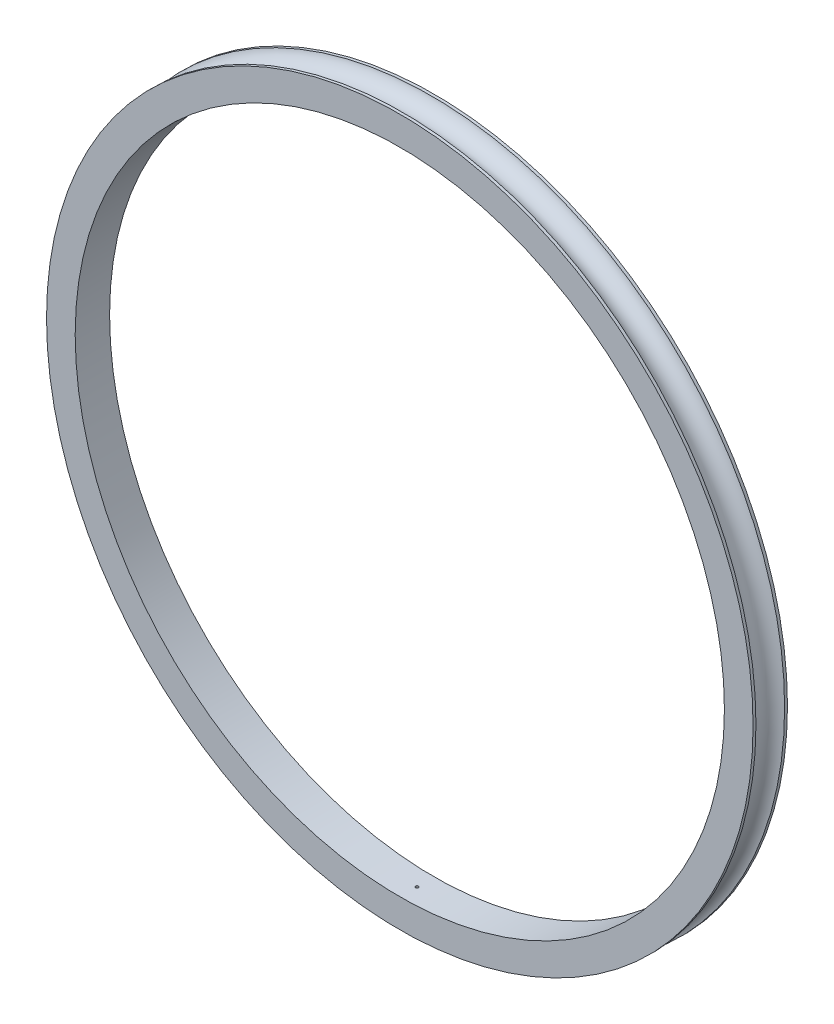
ISO-10303-21;
HEADER;
FILE_DESCRIPTION(('STEP AP214'),'2;1');
FILE_NAME('part.step','',(''),(''),'','','');
FILE_SCHEMA(('AUTOMOTIVE_DESIGN { 1 0 10303 214 1 1 1 1 }'));
ENDSEC;
DATA;
#1=APPLICATION_CONTEXT('core data for automotive mechanical design processes');
#2=APPLICATION_PROTOCOL_DEFINITION('international standard','automotive_design',2000,#1);
#3=PRODUCT_CONTEXT('',#1,'mechanical');
#4=PRODUCT('Part','Part','',(#3));
#5=PRODUCT_RELATED_PRODUCT_CATEGORY('part','',(#4));
#6=PRODUCT_DEFINITION_FORMATION('','',#4);
#7=PRODUCT_DEFINITION_CONTEXT('part definition',#1,'design');
#8=PRODUCT_DEFINITION('design','',#6,#7);
#9=PRODUCT_DEFINITION_SHAPE('','',#8);
#10=(LENGTH_UNIT() NAMED_UNIT(*) SI_UNIT(.MILLI.,.METRE.));
#11=(NAMED_UNIT(*) PLANE_ANGLE_UNIT() SI_UNIT($,.RADIAN.));
#12=(NAMED_UNIT(*) SI_UNIT($,.STERADIAN.) SOLID_ANGLE_UNIT());
#13=UNCERTAINTY_MEASURE_WITH_UNIT(LENGTH_MEASURE(1.E-05),#10,'distance_accuracy_value','');
#14=(GEOMETRIC_REPRESENTATION_CONTEXT(3) GLOBAL_UNCERTAINTY_ASSIGNED_CONTEXT((#13)) GLOBAL_UNIT_ASSIGNED_CONTEXT((#10,
#11,#12)) REPRESENTATION_CONTEXT('',''));
#15=CARTESIAN_POINT('',(0.,0.,0.));
#16=DIRECTION('',(0.,0.,1.));
#17=DIRECTION('',(1.,0.,0.));
#18=AXIS2_PLACEMENT_3D('',#15,#16,#17);
#19=CARTESIAN_POINT('',(0.,0.,80.7858217632019));
#20=DIRECTION('',(0.,0.,1.));
#21=DIRECTION('',(1.,0.,0.));
#22=AXIS2_PLACEMENT_3D('',#19,#20,#21);
#23=CYLINDRICAL_SURFACE('',#22,113.24716621);
#24=CARTESIAN_POINT('',(0.,0.,-5.99999999999999));
#25=DIRECTION('',(0.,0.,1.));
#26=DIRECTION('',(1.,0.,0.));
#27=AXIS2_PLACEMENT_3D('',#24,#25,#26);
#28=CIRCLE('',#27,113.24716621);
#29=CARTESIAN_POINT('',(113.24716621,0.,-5.99999999999999));
#30=VERTEX_POINT('',#29);
#31=EDGE_CURVE('E10',#30,#30,#28,.T.);
#32=ORIENTED_EDGE('',*,*,#31,.F.);
#33=EDGE_LOOP('',(#32));
#34=FACE_BOUND('',#33,.T.);
#35=CARTESIAN_POINT('',(0.,0.,6.00000000000001));
#36=DIRECTION('',(0.,0.,1.));
#37=DIRECTION('',(1.,0.,0.));
#38=AXIS2_PLACEMENT_3D('',#35,#36,#37);
#39=CIRCLE('',#38,113.24716621);
#40=CARTESIAN_POINT('',(113.24716621,0.,6.00000000000001));
#41=VERTEX_POINT('',#40);
#42=EDGE_CURVE('E62',#41,#41,#39,.T.);
#43=ORIENTED_EDGE('',*,*,#42,.T.);
#44=EDGE_LOOP('',(#43));
#45=FACE_BOUND('',#44,.T.);
#46=CARTESIAN_POINT('',(0.,113.24716621,0.5));
#47=CARTESIAN_POINT('',(-0.0280850726443126,113.247166195074,0.499998754627197));
#48=CARTESIAN_POINT('',(-0.0561905061239835,113.247155650258,0.497625745990981));
#49=CARTESIAN_POINT('',(-0.111627324699866,113.2471145986,0.488192279230288));
#50=CARTESIAN_POINT('',(-0.138957736940247,113.247084067735,0.481126179969488));
#51=CARTESIAN_POINT('',(-0.192033351037611,113.247006502595,0.46250770041119));
#52=CARTESIAN_POINT('',(-0.217779303653711,113.246959476208,0.450957464075767));
#53=CARTESIAN_POINT('',(-0.266959440226378,113.246854229004,0.423701526711973));
#54=CARTESIAN_POINT('',(-0.290394196813115,113.24679601097,0.40799685856923));
#55=CARTESIAN_POINT('',(-0.334297575428407,113.246674929301,0.372874571112933));
#56=CARTESIAN_POINT('',(-0.354765868728772,113.246612065153,0.353456540855887));
#57=CARTESIAN_POINT('',(-0.392152692303786,113.246488781309,0.31145899001049));
#58=CARTESIAN_POINT('',(-0.409071083131932,113.24642836171,0.28887934528635));
#59=CARTESIAN_POINT('',(-0.438876664259513,113.246316782586,0.241200476716012));
#60=CARTESIAN_POINT('',(-0.451763913187517,113.246265622927,0.216101289520828));
#61=CARTESIAN_POINT('',(-0.473141663153759,113.246178330635,0.164095600067725));
#62=CARTESIAN_POINT('',(-0.481632173223372,113.246142197972,0.137189101522346));
#63=CARTESIAN_POINT('',(-0.493975426743541,113.24608903346,0.0823326761827823));
#64=CARTESIAN_POINT('',(-0.497828192011973,113.246072001522,0.054382754297932));
#65=CARTESIAN_POINT('',(-0.500786648223638,113.246058958438,-0.00176715906982723));
#66=CARTESIAN_POINT('',(-0.499892347945962,113.246062947254,-0.0299671500901692));
#67=CARTESIAN_POINT('',(-0.493382103939976,113.246091495775,-0.0858165414675148));
#68=CARTESIAN_POINT('',(-0.487766191387806,113.246116055345,-0.113465945458733));
#69=CARTESIAN_POINT('',(-0.471972182082359,113.246182976294,-0.167429505712772));
#70=CARTESIAN_POINT('',(-0.46179408039958,113.246225337692,-0.193743660532805));
#71=CARTESIAN_POINT('',(-0.437164584173988,113.246323086535,-0.244289807809644));
#72=CARTESIAN_POINT('',(-0.422713175864576,113.246378474023,-0.268521793558349));
#73=CARTESIAN_POINT('',(-0.389947315899648,113.246496030469,-0.314215647426464));
#74=CARTESIAN_POINT('',(-0.371632865582639,113.246558199426,-0.335677516505689));
#75=CARTESIAN_POINT('',(-0.331660622040299,113.246682310422,-0.375222103881902));
#76=CARTESIAN_POINT('',(-0.310002799828359,113.246744252458,-0.393304792878824));
#77=CARTESIAN_POINT('',(-0.263958713663192,113.246860925619,-0.425577482561601));
#78=CARTESIAN_POINT('',(-0.239572449351861,113.246915656743,-0.439767482736546));
#79=CARTESIAN_POINT('',(-0.18876372077247,113.247011737584,-0.46385197553293));
#80=CARTESIAN_POINT('',(-0.162341256185237,113.247053087298,-0.473746467481051));
#81=CARTESIAN_POINT('',(-0.108210190130271,113.247117743424,-0.488959050783277));
#82=CARTESIAN_POINT('',(-0.0805015887950285,113.247141049837,-0.494277142608817));
#83=CARTESIAN_POINT('',(-0.0245850642340972,113.247166991616,-0.500185926265634));
#84=CARTESIAN_POINT('',(0.00362285477255126,113.247169627157,-0.500776658022181));
#85=CARTESIAN_POINT('',(0.0597374966472364,113.247153930515,-0.497214056297327));
#86=CARTESIAN_POINT('',(0.0876442195095471,113.247135598333,-0.493060722725735));
#87=CARTESIAN_POINT('',(0.142364168567434,113.247080033155,-0.480127923639521));
#88=CARTESIAN_POINT('',(0.169177398988621,113.247042800232,-0.47134847600354));
#89=CARTESIAN_POINT('',(0.220949341072637,113.24695363126,-0.449412691014909));
#90=CARTESIAN_POINT('',(0.245908052891495,113.246901695212,-0.43625635403051));
#91=CARTESIAN_POINT('',(0.293262638443112,113.246788974853,-0.405940158433058));
#92=CARTESIAN_POINT('',(0.315658495278256,113.246728190484,-0.38878027342577));
#93=CARTESIAN_POINT('',(0.357251458022419,113.24660462657,-0.350944131166159));
#94=CARTESIAN_POINT('',(0.376448562488145,113.246541847023,-0.33026787232724));
#95=CARTESIAN_POINT('',(0.411099198726588,113.246421370171,-0.28598574738278));
#96=CARTESIAN_POINT('',(0.426552703590167,113.246363672903,-0.262379860220801));
#97=CARTESIAN_POINT('',(0.453277263312564,113.246259866169,-0.212908714583959));
#98=CARTESIAN_POINT('',(0.464548322695467,113.24621375669,-0.187043458553058));
#99=CARTESIAN_POINT('',(0.482588013812692,113.246138324217,-0.133787899119342));
#100=CARTESIAN_POINT('',(0.489356663962868,113.246109001155,-0.106397601954781));
#101=CARTESIAN_POINT('',(0.498199464018572,113.246070447225,-0.0508693497111937));
#102=CARTESIAN_POINT('',(0.500273605736881,113.246061216392,-0.0227313933283364));
#103=CARTESIAN_POINT('',(0.499668485789901,113.24606388776,0.033493065741273));
#104=CARTESIAN_POINT('',(0.49698927356097,113.246075789742,0.0615795689601129));
#105=CARTESIAN_POINT('',(0.486953586454943,113.246119384465,0.116904178825799));
#106=CARTESIAN_POINT('',(0.47959710217483,113.246151077246,0.144142283766941));
#107=CARTESIAN_POINT('',(0.460415539341316,113.246230681203,0.196997326642429));
#108=CARTESIAN_POINT('',(0.448590377633274,113.246278592681,0.22261423439864));
#109=CARTESIAN_POINT('',(0.420807645071397,113.246385229927,0.271498180057277));
#110=CARTESIAN_POINT('',(0.404850236200105,113.246443955271,0.29476531002043));
#111=CARTESIAN_POINT('',(0.369257731467463,113.246565595214,0.338288285177159));
#112=CARTESIAN_POINT('',(0.349622989268236,113.246628509411,0.358544419613055));
#113=CARTESIAN_POINT('',(0.307225770102929,113.24675145585,0.39547793237453));
#114=CARTESIAN_POINT('',(0.284462517016839,113.246811487372,0.412154420024291));
#115=CARTESIAN_POINT('',(0.236450377144567,113.246921909687,0.441455418968024));
#116=CARTESIAN_POINT('',(0.211200299585207,113.246972295826,0.454077976660228));
#117=CARTESIAN_POINT('',(0.158959157690725,113.247057648375,0.474890257125589));
#118=CARTESIAN_POINT('',(0.131970223946102,113.247092633259,0.483085293455131));
#119=CARTESIAN_POINT('',(0.0873411009489131,113.247133838102,0.492626014150176));
#120=CARTESIAN_POINT('',(0.0699908952107105,113.247145925261,0.495387807152349));
#121=CARTESIAN_POINT('',(0.035096443837638,113.247162115874,0.499075189228983));
#122=CARTESIAN_POINT('',(0.0175521982039778,113.247166219328,0.500000778314892));
#123=CARTESIAN_POINT('',(0.,113.24716621,0.5));
#124=B_SPLINE_CURVE_WITH_KNOTS('',3,(#46,#47,#48,#49,#50,#51,#52,#53,#54,#55,#56,#57,#58,#59,
#60,#61,#62,#63,#64,#65,#66,#67,#68,#69,#70,#71,#72,#73,#74,#75,#76,#77,#78,#79,#80,#81,#82,#83,
#84,#85,#86,#87,#88,#89,#90,#91,#92,#93,#94,#95,#96,#97,#98,#99,#100,#101,#102,#103,#104,#105,
#106,#107,#108,#109,#110,#111,#112,#113,#114,#115,#116,#117,#118,#119,#120,#121,#122,#123),
.UNSPECIFIED.,.T.,.F.,(4,2,2,2,2,2,2,2,2,2,2,2,2,2,2,2,2,2,2,2,2,2,2,2,2,2,2,2,2,2,2,2,2,2,2,2,
2,2,4),(0.,0.0841911524058577,0.168483686911669,0.252735968885035,0.336967323492173,
0.421208005059153,0.505451995131177,0.589694759909137,0.673937351642701,0.758179547062601,
0.842421586687417,0.926663070078301,1.01090464449337,1.09514649029841,1.1793883069145,
1.26363085393743,1.34787341201708,1.43211598330168,1.5163585459081,1.60060039703695,
1.68484224976734,1.76908377692885,1.85332529700269,1.93756737247224,2.02180948595209,
2.10605220494951,2.19029483282261,2.27453711612252,2.3587795463408,2.44302110041679,
2.52726282384948,2.61150611495746,2.69574610425971,2.77997799606133,2.86423082193048,
2.9485241887941,3.03271616752045,3.08533272372367,3.13794927959888),.UNSPECIFIED.);
#125=CARTESIAN_POINT('',(0.,113.24716621,0.5));
#126=VERTEX_POINT('',#125);
#127=EDGE_CURVE('E56',#126,#126,#124,.T.);
#128=ORIENTED_EDGE('',*,*,#127,.F.);
#129=EDGE_LOOP('',(#128));
#130=FACE_BOUND('',#129,.T.);
#131=CARTESIAN_POINT('',(0.,-113.24716621,-0.5));
#132=CARTESIAN_POINT('',(-0.0280850726443126,-113.247166195074,-0.499998754627197));
#133=CARTESIAN_POINT('',(-0.0561905061239835,-113.247155650258,-0.497625745990981));
#134=CARTESIAN_POINT('',(-0.111627324699866,-113.2471145986,-0.488192279230288));
#135=CARTESIAN_POINT('',(-0.138957736940247,-113.247084067735,-0.481126179969488));
#136=CARTESIAN_POINT('',(-0.192033351037611,-113.247006502595,-0.46250770041119));
#137=CARTESIAN_POINT('',(-0.217779303653711,-113.246959476208,-0.450957464075767));
#138=CARTESIAN_POINT('',(-0.266959440226378,-113.246854229004,-0.423701526711973));
#139=CARTESIAN_POINT('',(-0.290394196813115,-113.24679601097,-0.40799685856923));
#140=CARTESIAN_POINT('',(-0.334297575428407,-113.246674929301,-0.372874571112933));
#141=CARTESIAN_POINT('',(-0.354765868728772,-113.246612065153,-0.353456540855887));
#142=CARTESIAN_POINT('',(-0.392152692303786,-113.246488781309,-0.31145899001049));
#143=CARTESIAN_POINT('',(-0.409071083131932,-113.24642836171,-0.28887934528635));
#144=CARTESIAN_POINT('',(-0.438876664259513,-113.246316782586,-0.241200476716012));
#145=CARTESIAN_POINT('',(-0.451763913187517,-113.246265622927,-0.216101289520828));
#146=CARTESIAN_POINT('',(-0.473141663153759,-113.246178330635,-0.164095600067725));
#147=CARTESIAN_POINT('',(-0.481632173223372,-113.246142197972,-0.137189101522346));
#148=CARTESIAN_POINT('',(-0.493975426743541,-113.24608903346,-0.0823326761827823));
#149=CARTESIAN_POINT('',(-0.497828192011973,-113.246072001522,-0.054382754297932));
#150=CARTESIAN_POINT('',(-0.500786648223638,-113.246058958438,0.00176715906982723));
#151=CARTESIAN_POINT('',(-0.499892347945962,-113.246062947254,0.0299671500901692));
#152=CARTESIAN_POINT('',(-0.493382103939976,-113.246091495775,0.0858165414675148));
#153=CARTESIAN_POINT('',(-0.487766191387806,-113.246116055345,0.113465945458733));
#154=CARTESIAN_POINT('',(-0.471972182082359,-113.246182976294,0.167429505712772));
#155=CARTESIAN_POINT('',(-0.46179408039958,-113.246225337692,0.193743660532805));
#156=CARTESIAN_POINT('',(-0.437164584173988,-113.246323086535,0.244289807809644));
#157=CARTESIAN_POINT('',(-0.422713175864576,-113.246378474023,0.268521793558349));
#158=CARTESIAN_POINT('',(-0.389947315899648,-113.246496030469,0.314215647426464));
#159=CARTESIAN_POINT('',(-0.371632865582639,-113.246558199426,0.335677516505689));
#160=CARTESIAN_POINT('',(-0.331660622040299,-113.246682310422,0.375222103881902));
#161=CARTESIAN_POINT('',(-0.310002799828359,-113.246744252458,0.393304792878824));
#162=CARTESIAN_POINT('',(-0.263958713663192,-113.246860925619,0.425577482561601));
#163=CARTESIAN_POINT('',(-0.239572449351861,-113.246915656743,0.439767482736546));
#164=CARTESIAN_POINT('',(-0.18876372077247,-113.247011737584,0.46385197553293));
#165=CARTESIAN_POINT('',(-0.162341256185237,-113.247053087298,0.473746467481051));
#166=CARTESIAN_POINT('',(-0.108210190130271,-113.247117743424,0.488959050783277));
#167=CARTESIAN_POINT('',(-0.0805015887950285,-113.247141049837,0.494277142608817));
#168=CARTESIAN_POINT('',(-0.0245850642340972,-113.247166991616,0.500185926265634));
#169=CARTESIAN_POINT('',(0.00362285477255126,-113.247169627157,0.500776658022181));
#170=CARTESIAN_POINT('',(0.0597374966472364,-113.247153930515,0.497214056297327));
#171=CARTESIAN_POINT('',(0.0876442195095471,-113.247135598333,0.493060722725735));
#172=CARTESIAN_POINT('',(0.142364168567434,-113.247080033155,0.480127923639521));
#173=CARTESIAN_POINT('',(0.169177398988621,-113.247042800232,0.47134847600354));
#174=CARTESIAN_POINT('',(0.220949341072637,-113.24695363126,0.449412691014909));
#175=CARTESIAN_POINT('',(0.245908052891495,-113.246901695212,0.43625635403051));
#176=CARTESIAN_POINT('',(0.293262638443112,-113.246788974853,0.405940158433058));
#177=CARTESIAN_POINT('',(0.315658495278256,-113.246728190484,0.38878027342577));
#178=CARTESIAN_POINT('',(0.357251458022419,-113.24660462657,0.350944131166159));
#179=CARTESIAN_POINT('',(0.376448562488145,-113.246541847023,0.33026787232724));
#180=CARTESIAN_POINT('',(0.411099198726588,-113.246421370171,0.28598574738278));
#181=CARTESIAN_POINT('',(0.426552703590167,-113.246363672903,0.262379860220801));
#182=CARTESIAN_POINT('',(0.453277263312564,-113.246259866169,0.212908714583959));
#183=CARTESIAN_POINT('',(0.464548322695467,-113.24621375669,0.187043458553058));
#184=CARTESIAN_POINT('',(0.482588013812692,-113.246138324217,0.133787899119342));
#185=CARTESIAN_POINT('',(0.489356663962868,-113.246109001155,0.106397601954781));
#186=CARTESIAN_POINT('',(0.498199464018572,-113.246070447225,0.0508693497111937));
#187=CARTESIAN_POINT('',(0.500273605736881,-113.246061216392,0.0227313933283364));
#188=CARTESIAN_POINT('',(0.499668485789901,-113.24606388776,-0.033493065741273));
#189=CARTESIAN_POINT('',(0.49698927356097,-113.246075789742,-0.0615795689601129));
#190=CARTESIAN_POINT('',(0.486953586454943,-113.246119384465,-0.116904178825799));
#191=CARTESIAN_POINT('',(0.47959710217483,-113.246151077246,-0.144142283766941));
#192=CARTESIAN_POINT('',(0.460415539341316,-113.246230681203,-0.196997326642429));
#193=CARTESIAN_POINT('',(0.448590377633274,-113.246278592681,-0.22261423439864));
#194=CARTESIAN_POINT('',(0.420807645071397,-113.246385229927,-0.271498180057277));
#195=CARTESIAN_POINT('',(0.404850236200105,-113.246443955271,-0.29476531002043));
#196=CARTESIAN_POINT('',(0.369257731467463,-113.246565595214,-0.338288285177159));
#197=CARTESIAN_POINT('',(0.349622989268236,-113.246628509411,-0.358544419613055));
#198=CARTESIAN_POINT('',(0.307225770102929,-113.24675145585,-0.39547793237453));
#199=CARTESIAN_POINT('',(0.284462517016839,-113.246811487372,-0.412154420024291));
#200=CARTESIAN_POINT('',(0.236450377144567,-113.246921909687,-0.441455418968024));
#201=CARTESIAN_POINT('',(0.211200299585207,-113.246972295826,-0.454077976660228));
#202=CARTESIAN_POINT('',(0.158959157690725,-113.247057648375,-0.474890257125589));
#203=CARTESIAN_POINT('',(0.131970223946102,-113.247092633259,-0.483085293455131));
#204=CARTESIAN_POINT('',(0.0873411009489131,-113.247133838102,-0.492626014150176));
#205=CARTESIAN_POINT('',(0.0699908952107105,-113.247145925261,-0.495387807152349));
#206=CARTESIAN_POINT('',(0.035096443837638,-113.247162115874,-0.499075189228983));
#207=CARTESIAN_POINT('',(0.0175521982039778,-113.247166219328,-0.500000778314892));
#208=CARTESIAN_POINT('',(0.,-113.24716621,-0.5));
#209=B_SPLINE_CURVE_WITH_KNOTS('',3,(#131,#132,#133,#134,#135,#136,#137,#138,#139,#140,#141,
#142,#143,#144,#145,#146,#147,#148,#149,#150,#151,#152,#153,#154,#155,#156,#157,#158,#159,#160,
#161,#162,#163,#164,#165,#166,#167,#168,#169,#170,#171,#172,#173,#174,#175,#176,#177,#178,#179,
#180,#181,#182,#183,#184,#185,#186,#187,#188,#189,#190,#191,#192,#193,#194,#195,#196,#197,#198,
#199,#200,#201,#202,#203,#204,#205,#206,#207,#208),.UNSPECIFIED.,.T.,.F.,(4,2,2,2,2,2,2,2,2,2,2,
2,2,2,2,2,2,2,2,2,2,2,2,2,2,2,2,2,2,2,2,2,2,2,2,2,2,2,4),(0.,0.0841911524058577,
0.168483686911669,0.252735968885035,0.336967323492173,0.421208005059153,0.505451995131177,
0.589694759909137,0.673937351642701,0.758179547062601,0.842421586687417,0.926663070078301,
1.01090464449337,1.09514649029841,1.1793883069145,1.26363085393743,1.34787341201708,
1.43211598330168,1.5163585459081,1.60060039703695,1.68484224976734,1.76908377692885,
1.85332529700269,1.93756737247224,2.02180948595209,2.10605220494951,2.19029483282261,
2.27453711612252,2.3587795463408,2.44302110041679,2.52726282384948,2.61150611495746,
2.69574610425971,2.77997799606133,2.86423082193048,2.9485241887941,3.03271616752045,
3.08533272372367,3.13794927959888),.UNSPECIFIED.);
#210=CARTESIAN_POINT('',(0.,-113.24716621,-0.5));
#211=VERTEX_POINT('',#210);
#212=EDGE_CURVE('E39',#211,#211,#209,.T.);
#213=ORIENTED_EDGE('',*,*,#212,.F.);
#214=EDGE_LOOP('',(#213));
#215=FACE_BOUND('',#214,.T.);
#216=ADVANCED_FACE('F35',(#34,#45,#130,#215),#23,.F.);
#217=CARTESIAN_POINT('',(0.,113.24716621,-6.));
#218=DIRECTION('',(0.,0.,1.));
#219=DIRECTION('',(1.,0.,0.));
#220=AXIS2_PLACEMENT_3D('',#217,#218,#219);
#221=PLANE('',#220);
#222=CARTESIAN_POINT('',(0.,0.,-5.99999999999999));
#223=DIRECTION('',(0.,0.,1.));
#224=DIRECTION('',(1.,0.,0.));
#225=AXIS2_PLACEMENT_3D('',#222,#223,#224);
#226=CIRCLE('',#225,123.24716621);
#227=CARTESIAN_POINT('',(123.24716621,0.,-5.99999999999999));
#228=VERTEX_POINT('',#227);
#229=EDGE_CURVE('E48',#228,#228,#226,.T.);
#230=ORIENTED_EDGE('',*,*,#229,.F.);
#231=EDGE_LOOP('',(#230));
#232=FACE_BOUND('',#231,.T.);
#233=ORIENTED_EDGE('',*,*,#31,.T.);
#234=EDGE_LOOP('',(#233));
#235=FACE_BOUND('',#234,.T.);
#236=ADVANCED_FACE('F37',(#232,#235),#221,.F.);
#237=CARTESIAN_POINT('',(0.,0.,80.7858217632019));
#238=DIRECTION('',(0.,0.,1.));
#239=DIRECTION('',(1.,0.,0.));
#240=AXIS2_PLACEMENT_3D('',#237,#238,#239);
#241=CYLINDRICAL_SURFACE('',#240,123.24716621);
#242=CARTESIAN_POINT('',(0.,0.,-5.));
#243=DIRECTION('',(0.,0.,1.));
#244=DIRECTION('',(1.,0.,0.));
#245=AXIS2_PLACEMENT_3D('',#242,#243,#244);
#246=CIRCLE('',#245,123.24716621);
#247=CARTESIAN_POINT('',(123.24716621,0.,-5.));
#248=VERTEX_POINT('',#247);
#249=EDGE_CURVE('E53',#248,#248,#246,.T.);
#250=ORIENTED_EDGE('',*,*,#249,.F.);
#251=EDGE_LOOP('',(#250));
#252=FACE_BOUND('',#251,.T.);
#253=ORIENTED_EDGE('',*,*,#229,.T.);
#254=EDGE_LOOP('',(#253));
#255=FACE_BOUND('',#254,.T.);
#256=ADVANCED_FACE('F91',(#252,#255),#241,.T.);
#257=CARTESIAN_POINT('',(0.,0.,0.));
#258=DIRECTION('',(0.,0.,1.));
#259=DIRECTION('',(1.,0.,0.));
#260=AXIS2_PLACEMENT_3D('',#257,#258,#259);
#261=TOROIDAL_SURFACE('',#260,124.37216621,5.125);
#262=CARTESIAN_POINT('',(0.,0.,5.));
#263=DIRECTION('',(0.,0.,1.));
#264=DIRECTION('',(1.,0.,0.));
#265=AXIS2_PLACEMENT_3D('',#262,#263,#264);
#266=CIRCLE('',#265,123.24716621);
#267=CARTESIAN_POINT('',(123.24716621,0.,5.));
#268=VERTEX_POINT('',#267);
#269=EDGE_CURVE('E112',#268,#268,#266,.T.);
#270=ORIENTED_EDGE('',*,*,#269,.F.);
#271=EDGE_LOOP('',(#270));
#272=FACE_BOUND('',#271,.T.);
#273=ORIENTED_EDGE('',*,*,#249,.T.);
#274=EDGE_LOOP('',(#273));
#275=FACE_BOUND('',#274,.T.);
#276=ADVANCED_FACE('F117',(#272,#275),#261,.F.);
#277=CARTESIAN_POINT('',(0.,0.,80.7858217632019));
#278=DIRECTION('',(0.,0.,1.));
#279=DIRECTION('',(1.,0.,0.));
#280=AXIS2_PLACEMENT_3D('',#277,#278,#279);
#281=CYLINDRICAL_SURFACE('',#280,123.24716621);
#282=CARTESIAN_POINT('',(0.,0.,6.00000000000001));
#283=DIRECTION('',(0.,0.,1.));
#284=DIRECTION('',(1.,0.,0.));
#285=AXIS2_PLACEMENT_3D('',#282,#283,#284);
#286=CIRCLE('',#285,123.24716621);
#287=CARTESIAN_POINT('',(123.24716621,0.,6.00000000000001));
#288=VERTEX_POINT('',#287);
#289=EDGE_CURVE('E109',#288,#288,#286,.T.);
#290=ORIENTED_EDGE('',*,*,#289,.F.);
#291=EDGE_LOOP('',(#290));
#292=FACE_BOUND('',#291,.T.);
#293=ORIENTED_EDGE('',*,*,#269,.T.);
#294=EDGE_LOOP('',(#293));
#295=FACE_BOUND('',#294,.T.);
#296=ADVANCED_FACE('F125',(#292,#295),#281,.T.);
#297=CARTESIAN_POINT('',(0.,123.24716621,6.));
#298=DIRECTION('',(0.,0.,-1.));
#299=DIRECTION('',(-1.,0.,0.));
#300=AXIS2_PLACEMENT_3D('',#297,#298,#299);
#301=PLANE('',#300);
#302=ORIENTED_EDGE('',*,*,#42,.F.);
#303=EDGE_LOOP('',(#302));
#304=FACE_BOUND('',#303,.T.);
#305=ORIENTED_EDGE('',*,*,#289,.T.);
#306=EDGE_LOOP('',(#305));
#307=FACE_BOUND('',#306,.T.);
#308=ADVANCED_FACE('F71',(#304,#307),#301,.F.);
#309=CARTESIAN_POINT('',(0.,86.24716621,0.));
#310=DIRECTION('',(0.,1.,0.));
#311=DIRECTION('',(0.,0.,1.));
#312=AXIS2_PLACEMENT_3D('',#309,#310,#311);
#313=CYLINDRICAL_SURFACE('',#312,0.5);
#314=CARTESIAN_POINT('',(0.,115.24716621,0.));
#315=DIRECTION('',(0.,-1.,0.));
#316=DIRECTION('',(0.,0.,-1.));
#317=AXIS2_PLACEMENT_3D('',#314,#315,#316);
#318=CIRCLE('',#317,0.5);
#319=CARTESIAN_POINT('',(0.,115.24716621,-0.5));
#320=VERTEX_POINT('',#319);
#321=EDGE_CURVE('E63',#320,#320,#318,.T.);
#322=ORIENTED_EDGE('',*,*,#321,.F.);
#323=EDGE_LOOP('',(#322));
#324=FACE_BOUND('',#323,.T.);
#325=ORIENTED_EDGE('',*,*,#127,.T.);
#326=EDGE_LOOP('',(#325));
#327=FACE_BOUND('',#326,.T.);
#328=ADVANCED_FACE('F66',(#324,#327),#313,.F.);
#329=CARTESIAN_POINT('',(0.,115.24716621,0.));
#330=DIRECTION('',(0.,-1.,0.));
#331=DIRECTION('',(0.,0.,-1.));
#332=AXIS2_PLACEMENT_3D('',#329,#330,#331);
#333=PLANE('',#332);
#334=ORIENTED_EDGE('',*,*,#321,.T.);
#335=EDGE_LOOP('',(#334));
#336=FACE_BOUND('',#335,.T.);
#337=ADVANCED_FACE('F70',(#336),#333,.T.);
#338=CARTESIAN_POINT('',(0.,-104.24716621,0.));
#339=DIRECTION('',(0.,-1.,0.));
#340=DIRECTION('',(0.,0.,-1.));
#341=AXIS2_PLACEMENT_3D('',#338,#339,#340);
#342=CYLINDRICAL_SURFACE('',#341,0.5);
#343=CARTESIAN_POINT('',(0.,-115.24716621,0.));
#344=DIRECTION('',(0.,1.,0.));
#345=DIRECTION('',(0.,0.,1.));
#346=AXIS2_PLACEMENT_3D('',#343,#344,#345);
#347=CIRCLE('',#346,0.5);
#348=CARTESIAN_POINT('',(0.,-115.24716621,0.5));
#349=VERTEX_POINT('',#348);
#350=EDGE_CURVE('E102',#349,#349,#347,.T.);
#351=ORIENTED_EDGE('',*,*,#350,.F.);
#352=EDGE_LOOP('',(#351));
#353=FACE_BOUND('',#352,.T.);
#354=ORIENTED_EDGE('',*,*,#212,.T.);
#355=EDGE_LOOP('',(#354));
#356=FACE_BOUND('',#355,.T.);
#357=ADVANCED_FACE('F74',(#353,#356),#342,.F.);
#358=CARTESIAN_POINT('',(0.,-115.24716621,0.));
#359=DIRECTION('',(0.,1.,0.));
#360=DIRECTION('',(0.,0.,1.));
#361=AXIS2_PLACEMENT_3D('',#358,#359,#360);
#362=PLANE('',#361);
#363=ORIENTED_EDGE('',*,*,#350,.T.);
#364=EDGE_LOOP('',(#363));
#365=FACE_BOUND('',#364,.T.);
#366=ADVANCED_FACE('F79',(#365),#362,.T.);
#367=CLOSED_SHELL('',(#216,#236,#256,#276,#296,#308,#328,#337,#357,#366));
#368=MANIFOLD_SOLID_BREP('B2',#367);
#369=ADVANCED_BREP_SHAPE_REPRESENTATION('',(#18,#368),#14);
#370=SHAPE_DEFINITION_REPRESENTATION(#9,#369);
ENDSEC;
END-ISO-10303-21;
